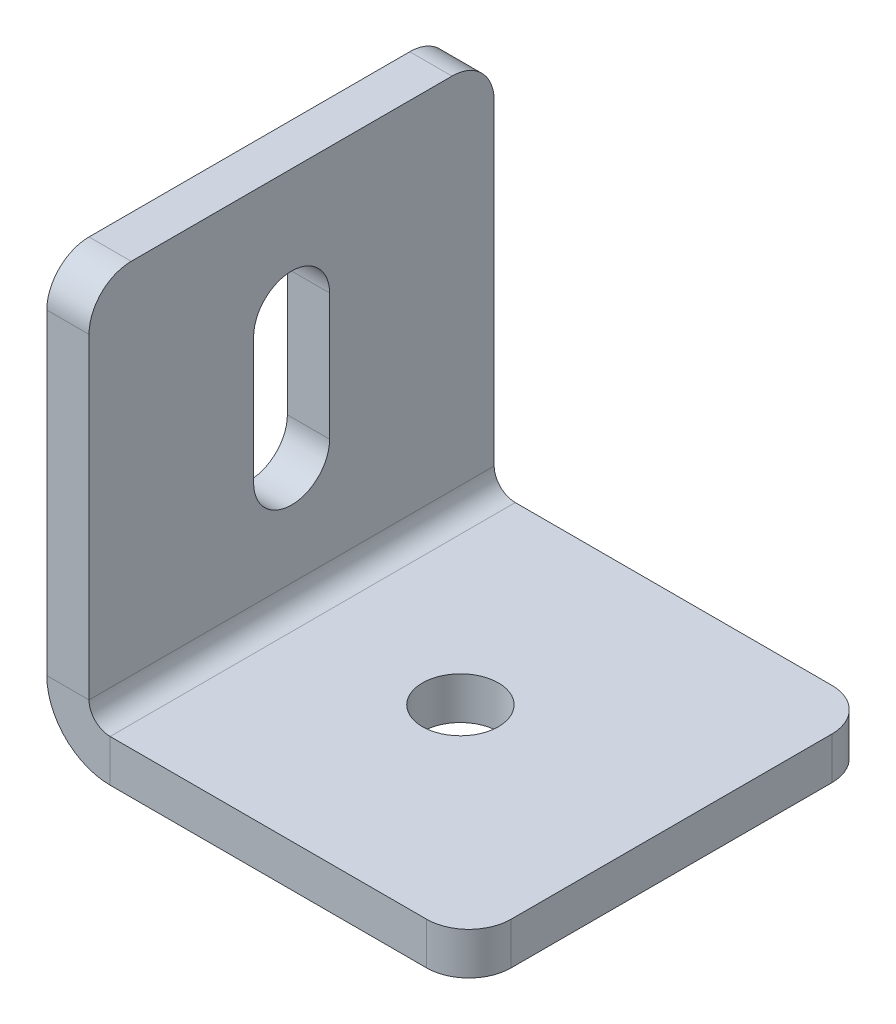
ISO-10303-21;
HEADER;
FILE_DESCRIPTION(('STEP AP214'),'2;1');
FILE_NAME('part.step','',(''),(''),'','','');
FILE_SCHEMA(('AUTOMOTIVE_DESIGN { 1 0 10303 214 1 1 1 1 }'));
ENDSEC;
DATA;
#1=APPLICATION_CONTEXT('core data for automotive mechanical design processes');
#2=APPLICATION_PROTOCOL_DEFINITION('international standard','automotive_design',2000,#1);
#3=PRODUCT_CONTEXT('',#1,'mechanical');
#4=PRODUCT('Part','Part','',(#3));
#5=PRODUCT_RELATED_PRODUCT_CATEGORY('part','',(#4));
#6=PRODUCT_DEFINITION_FORMATION('','',#4);
#7=PRODUCT_DEFINITION_CONTEXT('part definition',#1,'design');
#8=PRODUCT_DEFINITION('design','',#6,#7);
#9=PRODUCT_DEFINITION_SHAPE('','',#8);
#10=(LENGTH_UNIT() NAMED_UNIT(*) SI_UNIT(.MILLI.,.METRE.));
#11=(NAMED_UNIT(*) PLANE_ANGLE_UNIT() SI_UNIT($,.RADIAN.));
#12=(NAMED_UNIT(*) SI_UNIT($,.STERADIAN.) SOLID_ANGLE_UNIT());
#13=UNCERTAINTY_MEASURE_WITH_UNIT(LENGTH_MEASURE(1.E-05),#10,'distance_accuracy_value','');
#14=(GEOMETRIC_REPRESENTATION_CONTEXT(3) GLOBAL_UNCERTAINTY_ASSIGNED_CONTEXT((#13)) GLOBAL_UNIT_ASSIGNED_CONTEXT((#10,
#11,#12)) REPRESENTATION_CONTEXT('',''));
#15=CARTESIAN_POINT('',(0.,0.,0.));
#16=DIRECTION('',(0.,0.,1.));
#17=DIRECTION('',(1.,0.,0.));
#18=AXIS2_PLACEMENT_3D('',#15,#16,#17);
#19=CARTESIAN_POINT('',(0.,20.,0.));
#20=DIRECTION('',(-1.,0.,0.));
#21=DIRECTION('',(0.,0.,1.));
#22=AXIS2_PLACEMENT_3D('',#19,#20,#21);
#23=CYLINDRICAL_SURFACE('',#22,4.5);
#24=CARTESIAN_POINT('',(5.,20.,0.));
#25=DIRECTION('',(1.,0.,0.));
#26=DIRECTION('',(0.,0.,-1.));
#27=AXIS2_PLACEMENT_3D('',#24,#25,#26);
#28=CIRCLE('',#27,4.5);
#29=CARTESIAN_POINT('',(5.,20.,4.5));
#30=VERTEX_POINT('',#29);
#31=CARTESIAN_POINT('',(5.,20.,-4.5));
#32=VERTEX_POINT('',#31);
#33=EDGE_CURVE('E283',#30,#32,#28,.T.);
#34=ORIENTED_EDGE('',*,*,#33,.T.);
#35=DIRECTION('',(1.,0.,0.));
#36=VECTOR('',#35,1.);
#37=CARTESIAN_POINT('',(0.,20.,-4.5));
#38=LINE('',#37,#36);
#39=CARTESIAN_POINT('',(0.,20.,-4.5));
#40=VERTEX_POINT('',#39);
#41=EDGE_CURVE('E203',#40,#32,#38,.T.);
#42=ORIENTED_EDGE('',*,*,#41,.F.);
#43=CARTESIAN_POINT('',(0.,20.,0.));
#44=DIRECTION('',(1.,0.,0.));
#45=DIRECTION('',(0.,0.,-1.));
#46=AXIS2_PLACEMENT_3D('',#43,#44,#45);
#47=CIRCLE('',#46,4.5);
#48=CARTESIAN_POINT('',(0.,20.,4.5));
#49=VERTEX_POINT('',#48);
#50=EDGE_CURVE('E208',#49,#40,#47,.T.);
#51=ORIENTED_EDGE('',*,*,#50,.F.);
#52=DIRECTION('',(1.,0.,0.));
#53=VECTOR('',#52,1.);
#54=CARTESIAN_POINT('',(0.,20.,4.5));
#55=LINE('',#54,#53);
#56=EDGE_CURVE('E170',#49,#30,#55,.T.);
#57=ORIENTED_EDGE('',*,*,#56,.T.);
#58=EDGE_LOOP('',(#34,#42,#51,#57));
#59=FACE_BOUND('',#58,.T.);
#60=ADVANCED_FACE('F48',(#59),#23,.F.);
#61=CARTESIAN_POINT('',(0.,0.,24.));
#62=DIRECTION('',(0.,0.,-1.));
#63=DIRECTION('',(0.,-1.,0.));
#64=AXIS2_PLACEMENT_3D('',#61,#62,#63);
#65=PLANE('',#64);
#66=DIRECTION('',(0.,1.,0.));
#67=VECTOR('',#66,1.);
#68=CARTESIAN_POINT('',(5.,0.,24.));
#69=LINE('',#68,#67);
#70=CARTESIAN_POINT('',(5.,45.,24.));
#71=VERTEX_POINT('',#70);
#72=CARTESIAN_POINT('',(5.,7.5,24.));
#73=VERTEX_POINT('',#72);
#74=EDGE_CURVE('E289',#71,#73,#69,.F.);
#75=ORIENTED_EDGE('',*,*,#74,.F.);
#76=DIRECTION('',(1.,0.,0.));
#77=VECTOR('',#76,1.);
#78=CARTESIAN_POINT('',(0.,45.,24.));
#79=LINE('',#78,#77);
#80=CARTESIAN_POINT('',(0.,45.,24.));
#81=VERTEX_POINT('',#80);
#82=EDGE_CURVE('E11',#71,#81,#79,.F.);
#83=ORIENTED_EDGE('',*,*,#82,.T.);
#84=DIRECTION('',(0.,-1.,0.));
#85=VECTOR('',#84,1.);
#86=CARTESIAN_POINT('',(0.,0.,24.));
#87=LINE('',#86,#85);
#88=CARTESIAN_POINT('',(0.,7.5,24.));
#89=VERTEX_POINT('',#88);
#90=EDGE_CURVE('E211',#81,#89,#87,.T.);
#91=ORIENTED_EDGE('',*,*,#90,.T.);
#92=DIRECTION('',(-1.,0.,0.));
#93=VECTOR('',#92,1.);
#94=CARTESIAN_POINT('',(0.,7.5,24.));
#95=LINE('',#94,#93);
#96=EDGE_CURVE('E305',#73,#89,#95,.T.);
#97=ORIENTED_EDGE('',*,*,#96,.F.);
#98=EDGE_LOOP('',(#75,#83,#91,#97));
#99=FACE_BOUND('',#98,.T.);
#100=ADVANCED_FACE('F385',(#99),#65,.F.);
#101=CARTESIAN_POINT('',(0.,50.,-24.));
#102=DIRECTION('',(0.,-1.,0.));
#103=DIRECTION('',(0.,0.,1.));
#104=AXIS2_PLACEMENT_3D('',#101,#102,#103);
#105=PLANE('',#104);
#106=DIRECTION('',(0.,0.,1.));
#107=VECTOR('',#106,1.);
#108=CARTESIAN_POINT('',(5.,50.,-24.));
#109=LINE('',#108,#107);
#110=CARTESIAN_POINT('',(5.,50.,-19.));
#111=VERTEX_POINT('',#110);
#112=CARTESIAN_POINT('',(5.,50.,19.));
#113=VERTEX_POINT('',#112);
#114=EDGE_CURVE('E286',#111,#113,#109,.T.);
#115=ORIENTED_EDGE('',*,*,#114,.F.);
#116=DIRECTION('',(-1.,0.,0.));
#117=VECTOR('',#116,1.);
#118=CARTESIAN_POINT('',(0.,50.,-19.));
#119=LINE('',#118,#117);
#120=CARTESIAN_POINT('',(0.,50.,-19.));
#121=VERTEX_POINT('',#120);
#122=EDGE_CURVE('E340',#111,#121,#119,.T.);
#123=ORIENTED_EDGE('',*,*,#122,.T.);
#124=DIRECTION('',(0.,0.,1.));
#125=VECTOR('',#124,1.);
#126=CARTESIAN_POINT('',(0.,50.,-24.));
#127=LINE('',#126,#125);
#128=CARTESIAN_POINT('',(0.,50.,19.));
#129=VERTEX_POINT('',#128);
#130=EDGE_CURVE('E215',#121,#129,#127,.T.);
#131=ORIENTED_EDGE('',*,*,#130,.T.);
#132=DIRECTION('',(1.,0.,0.));
#133=VECTOR('',#132,1.);
#134=CARTESIAN_POINT('',(0.,50.,19.));
#135=LINE('',#134,#133);
#136=EDGE_CURVE('E337',#129,#113,#135,.T.);
#137=ORIENTED_EDGE('',*,*,#136,.T.);
#138=EDGE_LOOP('',(#115,#123,#131,#137));
#139=FACE_BOUND('',#138,.T.);
#140=ADVANCED_FACE('F365',(#139),#105,.F.);
#141=CARTESIAN_POINT('',(0.,0.,-24.));
#142=DIRECTION('',(0.,0.,-1.));
#143=DIRECTION('',(0.,-1.,0.));
#144=AXIS2_PLACEMENT_3D('',#141,#142,#143);
#145=PLANE('',#144);
#146=DIRECTION('',(0.,-1.,0.));
#147=VECTOR('',#146,1.);
#148=CARTESIAN_POINT('',(0.,0.,-24.));
#149=LINE('',#148,#147);
#150=CARTESIAN_POINT('',(0.,45.,-24.));
#151=VERTEX_POINT('',#150);
#152=CARTESIAN_POINT('',(0.,7.5,-24.));
#153=VERTEX_POINT('',#152);
#154=EDGE_CURVE('E219',#151,#153,#149,.T.);
#155=ORIENTED_EDGE('',*,*,#154,.F.);
#156=DIRECTION('',(1.,0.,0.));
#157=VECTOR('',#156,1.);
#158=CARTESIAN_POINT('',(0.,45.,-24.));
#159=LINE('',#158,#157);
#160=CARTESIAN_POINT('',(5.,45.,-24.));
#161=VERTEX_POINT('',#160);
#162=EDGE_CURVE('E350',#151,#161,#159,.T.);
#163=ORIENTED_EDGE('',*,*,#162,.T.);
#164=DIRECTION('',(0.,1.,0.));
#165=VECTOR('',#164,1.);
#166=CARTESIAN_POINT('',(5.,0.,-24.));
#167=LINE('',#166,#165);
#168=CARTESIAN_POINT('',(5.,7.5,-24.));
#169=VERTEX_POINT('',#168);
#170=EDGE_CURVE('E268',#161,#169,#167,.F.);
#171=ORIENTED_EDGE('',*,*,#170,.T.);
#172=DIRECTION('',(-1.,0.,0.));
#173=VECTOR('',#172,1.);
#174=CARTESIAN_POINT('',(0.,7.5,-24.));
#175=LINE('',#174,#173);
#176=EDGE_CURVE('E301',#169,#153,#175,.T.);
#177=ORIENTED_EDGE('',*,*,#176,.T.);
#178=EDGE_LOOP('',(#155,#163,#171,#177));
#179=FACE_BOUND('',#178,.T.);
#180=ADVANCED_FACE('F371',(#179),#145,.T.);
#181=CARTESIAN_POINT('',(7.5,7.5,-24.));
#182=DIRECTION('',(0.,0.,1.));
#183=DIRECTION('',(1.,0.,0.));
#184=AXIS2_PLACEMENT_3D('',#181,#182,#183);
#185=PLANE('',#184);
#186=ORIENTED_EDGE('',*,*,#176,.F.);
#187=CARTESIAN_POINT('',(7.5,7.5,-24.));
#188=DIRECTION('',(0.,0.,1.));
#189=DIRECTION('',(1.,0.,0.));
#190=AXIS2_PLACEMENT_3D('',#187,#188,#189);
#191=CIRCLE('',#190,2.5);
#192=CARTESIAN_POINT('',(7.5,5.,-24.));
#193=VERTEX_POINT('',#192);
#194=EDGE_CURVE('E279',#169,#193,#191,.T.);
#195=ORIENTED_EDGE('',*,*,#194,.T.);
#196=DIRECTION('',(0.,-1.,0.));
#197=VECTOR('',#196,1.);
#198=CARTESIAN_POINT('',(7.5,0.,-24.));
#199=LINE('',#198,#197);
#200=CARTESIAN_POINT('',(7.5,0.,-24.));
#201=VERTEX_POINT('',#200);
#202=EDGE_CURVE('E298',#193,#201,#199,.T.);
#203=ORIENTED_EDGE('',*,*,#202,.T.);
#204=CARTESIAN_POINT('',(7.5,7.5,-24.));
#205=DIRECTION('',(0.,0.,-1.));
#206=DIRECTION('',(-1.,0.,0.));
#207=AXIS2_PLACEMENT_3D('',#204,#205,#206);
#208=CIRCLE('',#207,7.5);
#209=EDGE_CURVE('E212',#153,#201,#208,.F.);
#210=ORIENTED_EDGE('',*,*,#209,.F.);
#211=EDGE_LOOP('',(#186,#195,#203,#210));
#212=FACE_BOUND('',#211,.T.);
#213=ADVANCED_FACE('F376',(#212),#185,.F.);
#214=CARTESIAN_POINT('',(50.,0.,-24.));
#215=DIRECTION('',(0.,0.,-1.));
#216=DIRECTION('',(1.,0.,0.));
#217=AXIS2_PLACEMENT_3D('',#214,#215,#216);
#218=PLANE('',#217);
#219=DIRECTION('',(1.,0.,0.));
#220=VECTOR('',#219,1.);
#221=CARTESIAN_POINT('',(50.,5.,-24.));
#222=LINE('',#221,#220);
#223=CARTESIAN_POINT('',(45.,5.,-24.));
#224=VERTEX_POINT('',#223);
#225=EDGE_CURVE('E262',#193,#224,#222,.T.);
#226=ORIENTED_EDGE('',*,*,#225,.T.);
#227=DIRECTION('',(0.,-1.,0.));
#228=VECTOR('',#227,1.);
#229=CARTESIAN_POINT('',(45.,0.,-24.));
#230=LINE('',#229,#228);
#231=CARTESIAN_POINT('',(45.,0.,-24.));
#232=VERTEX_POINT('',#231);
#233=EDGE_CURVE('E309',#224,#232,#230,.T.);
#234=ORIENTED_EDGE('',*,*,#233,.T.);
#235=DIRECTION('',(1.,0.,0.));
#236=VECTOR('',#235,1.);
#237=CARTESIAN_POINT('',(50.,0.,-24.));
#238=LINE('',#237,#236);
#239=EDGE_CURVE('E234',#201,#232,#238,.T.);
#240=ORIENTED_EDGE('',*,*,#239,.F.);
#241=ORIENTED_EDGE('',*,*,#202,.F.);
#242=EDGE_LOOP('',(#226,#234,#240,#241));
#243=FACE_BOUND('',#242,.T.);
#244=ADVANCED_FACE('F418',(#243),#218,.T.);
#245=CARTESIAN_POINT('',(50.,0.,-24.));
#246=DIRECTION('',(1.,0.,0.));
#247=DIRECTION('',(0.,0.,1.));
#248=AXIS2_PLACEMENT_3D('',#245,#246,#247);
#249=PLANE('',#248);
#250=DIRECTION('',(0.,0.,1.));
#251=VECTOR('',#250,1.);
#252=CARTESIAN_POINT('',(50.,0.,-24.));
#253=LINE('',#252,#251);
#254=CARTESIAN_POINT('',(50.,0.,-19.));
#255=VERTEX_POINT('',#254);
#256=CARTESIAN_POINT('',(50.,0.,19.));
#257=VERTEX_POINT('',#256);
#258=EDGE_CURVE('E226',#255,#257,#253,.T.);
#259=ORIENTED_EDGE('',*,*,#258,.F.);
#260=DIRECTION('',(0.,-1.,0.));
#261=VECTOR('',#260,1.);
#262=CARTESIAN_POINT('',(50.,0.,-19.));
#263=LINE('',#262,#261);
#264=CARTESIAN_POINT('',(50.,5.,-19.));
#265=VERTEX_POINT('',#264);
#266=EDGE_CURVE('E325',#255,#265,#263,.F.);
#267=ORIENTED_EDGE('',*,*,#266,.T.);
#268=DIRECTION('',(0.,0.,1.));
#269=VECTOR('',#268,1.);
#270=CARTESIAN_POINT('',(50.,5.,-24.));
#271=LINE('',#270,#269);
#272=CARTESIAN_POINT('',(50.,5.,19.));
#273=VERTEX_POINT('',#272);
#274=EDGE_CURVE('E267',#265,#273,#271,.T.);
#275=ORIENTED_EDGE('',*,*,#274,.T.);
#276=DIRECTION('',(0.,1.,0.));
#277=VECTOR('',#276,1.);
#278=CARTESIAN_POINT('',(50.,0.,19.));
#279=LINE('',#278,#277);
#280=EDGE_CURVE('E321',#273,#257,#279,.F.);
#281=ORIENTED_EDGE('',*,*,#280,.T.);
#282=EDGE_LOOP('',(#259,#267,#275,#281));
#283=FACE_BOUND('',#282,.T.);
#284=ADVANCED_FACE('F409',(#283),#249,.T.);
#285=CARTESIAN_POINT('',(50.,0.,24.));
#286=DIRECTION('',(0.,0.,-1.));
#287=DIRECTION('',(1.,0.,0.));
#288=AXIS2_PLACEMENT_3D('',#285,#286,#287);
#289=PLANE('',#288);
#290=DIRECTION('',(1.,0.,0.));
#291=VECTOR('',#290,1.);
#292=CARTESIAN_POINT('',(50.,0.,24.));
#293=LINE('',#292,#291);
#294=CARTESIAN_POINT('',(7.5,0.,24.));
#295=VERTEX_POINT('',#294);
#296=CARTESIAN_POINT('',(45.,0.,24.));
#297=VERTEX_POINT('',#296);
#298=EDGE_CURVE('E230',#295,#297,#293,.T.);
#299=ORIENTED_EDGE('',*,*,#298,.T.);
#300=DIRECTION('',(0.,-1.,0.));
#301=VECTOR('',#300,1.);
#302=CARTESIAN_POINT('',(45.,0.,24.));
#303=LINE('',#302,#301);
#304=CARTESIAN_POINT('',(45.,5.,24.));
#305=VERTEX_POINT('',#304);
#306=EDGE_CURVE('E334',#297,#305,#303,.F.);
#307=ORIENTED_EDGE('',*,*,#306,.T.);
#308=DIRECTION('',(1.,0.,0.));
#309=VECTOR('',#308,1.);
#310=CARTESIAN_POINT('',(50.,5.,24.));
#311=LINE('',#310,#309);
#312=CARTESIAN_POINT('',(7.5,5.,24.));
#313=VERTEX_POINT('',#312);
#314=EDGE_CURVE('E269',#313,#305,#311,.T.);
#315=ORIENTED_EDGE('',*,*,#314,.F.);
#316=DIRECTION('',(0.,-1.,0.));
#317=VECTOR('',#316,1.);
#318=CARTESIAN_POINT('',(7.5,0.,24.));
#319=LINE('',#318,#317);
#320=EDGE_CURVE('E246',#313,#295,#319,.T.);
#321=ORIENTED_EDGE('',*,*,#320,.T.);
#322=EDGE_LOOP('',(#299,#307,#315,#321));
#323=FACE_BOUND('',#322,.T.);
#324=ADVANCED_FACE('F396',(#323),#289,.F.);
#325=CARTESIAN_POINT('',(25.,0.,0.));
#326=DIRECTION('',(0.,-1.,0.));
#327=DIRECTION('',(1.,0.,0.));
#328=AXIS2_PLACEMENT_3D('',#325,#326,#327);
#329=CYLINDRICAL_SURFACE('',#328,4.5);
#330=CARTESIAN_POINT('',(25.,0.,0.));
#331=DIRECTION('',(0.,-1.,0.));
#332=DIRECTION('',(0.,0.,-1.));
#333=AXIS2_PLACEMENT_3D('',#330,#331,#332);
#334=CIRCLE('',#333,4.5);
#335=CARTESIAN_POINT('',(25.,0.,-4.49999999999999));
#336=VERTEX_POINT('',#335);
#337=EDGE_CURVE('E222',#336,#336,#334,.T.);
#338=ORIENTED_EDGE('',*,*,#337,.T.);
#339=EDGE_LOOP('',(#338));
#340=FACE_BOUND('',#339,.T.);
#341=CARTESIAN_POINT('',(25.,5.,0.));
#342=DIRECTION('',(0.,-1.,0.));
#343=DIRECTION('',(0.,0.,-1.));
#344=AXIS2_PLACEMENT_3D('',#341,#342,#343);
#345=CIRCLE('',#344,4.5);
#346=CARTESIAN_POINT('',(25.,5.,-4.49999999999999));
#347=VERTEX_POINT('',#346);
#348=EDGE_CURVE('E263',#347,#347,#345,.T.);
#349=ORIENTED_EDGE('',*,*,#348,.F.);
#350=EDGE_LOOP('',(#349));
#351=FACE_BOUND('',#350,.T.);
#352=ADVANCED_FACE('F471',(#340,#351),#329,.F.);
#353=CARTESIAN_POINT('',(7.5,7.5,24.));
#354=DIRECTION('',(0.,0.,-1.));
#355=DIRECTION('',(-1.,0.,0.));
#356=AXIS2_PLACEMENT_3D('',#353,#354,#355);
#357=PLANE('',#356);
#358=CARTESIAN_POINT('',(7.5,7.5,24.));
#359=DIRECTION('',(0.,0.,1.));
#360=DIRECTION('',(1.,0.,0.));
#361=AXIS2_PLACEMENT_3D('',#358,#359,#360);
#362=CIRCLE('',#361,2.5);
#363=EDGE_CURVE('E202',#313,#73,#362,.F.);
#364=ORIENTED_EDGE('',*,*,#363,.T.);
#365=ORIENTED_EDGE('',*,*,#96,.T.);
#366=CARTESIAN_POINT('',(7.5,7.5,24.));
#367=DIRECTION('',(0.,0.,1.));
#368=DIRECTION('',(1.,0.,0.));
#369=AXIS2_PLACEMENT_3D('',#366,#367,#368);
#370=CIRCLE('',#369,7.5);
#371=EDGE_CURVE('E247',#295,#89,#370,.F.);
#372=ORIENTED_EDGE('',*,*,#371,.F.);
#373=ORIENTED_EDGE('',*,*,#320,.F.);
#374=EDGE_LOOP('',(#364,#365,#372,#373));
#375=FACE_BOUND('',#374,.T.);
#376=ADVANCED_FACE('F388',(#375),#357,.F.);
#377=CARTESIAN_POINT('',(50.,0.,-24.));
#378=DIRECTION('',(0.,-1.,0.));
#379=DIRECTION('',(1.,0.,0.));
#380=AXIS2_PLACEMENT_3D('',#377,#378,#379);
#381=PLANE('',#380);
#382=ORIENTED_EDGE('',*,*,#337,.F.);
#383=EDGE_LOOP('',(#382));
#384=FACE_BOUND('',#383,.T.);
#385=ORIENTED_EDGE('',*,*,#239,.T.);
#386=CARTESIAN_POINT('',(45.,0.,-19.));
#387=DIRECTION('',(0.,-1.,0.));
#388=DIRECTION('',(1.,0.,0.));
#389=AXIS2_PLACEMENT_3D('',#386,#387,#388);
#390=CIRCLE('',#389,5.);
#391=EDGE_CURVE('E318',#232,#255,#390,.T.);
#392=ORIENTED_EDGE('',*,*,#391,.T.);
#393=ORIENTED_EDGE('',*,*,#258,.T.);
#394=CARTESIAN_POINT('',(45.,0.,19.));
#395=DIRECTION('',(0.,-1.,0.));
#396=DIRECTION('',(1.,0.,0.));
#397=AXIS2_PLACEMENT_3D('',#394,#395,#396);
#398=CIRCLE('',#397,5.);
#399=EDGE_CURVE('E315',#257,#297,#398,.T.);
#400=ORIENTED_EDGE('',*,*,#399,.T.);
#401=ORIENTED_EDGE('',*,*,#298,.F.);
#402=DIRECTION('',(0.,0.,1.));
#403=VECTOR('',#402,1.);
#404=CARTESIAN_POINT('',(7.5,0.,-24.));
#405=LINE('',#404,#403);
#406=EDGE_CURVE('E242',#295,#201,#405,.F.);
#407=ORIENTED_EDGE('',*,*,#406,.T.);
#408=EDGE_LOOP('',(#385,#392,#393,#400,#401,#407));
#409=FACE_BOUND('',#408,.T.);
#410=ADVANCED_FACE('F412',(#384,#409),#381,.T.);
#411=CARTESIAN_POINT('',(0.,0.,-24.));
#412=DIRECTION('',(-1.,0.,0.));
#413=DIRECTION('',(0.,0.,1.));
#414=AXIS2_PLACEMENT_3D('',#411,#412,#413);
#415=PLANE('',#414);
#416=DIRECTION('',(0.,1.,0.));
#417=VECTOR('',#416,1.);
#418=CARTESIAN_POINT('',(0.,35.,-4.5));
#419=LINE('',#418,#417);
#420=CARTESIAN_POINT('',(0.,35.,-4.5));
#421=VERTEX_POINT('',#420);
#422=EDGE_CURVE('E171',#40,#421,#419,.T.);
#423=ORIENTED_EDGE('',*,*,#422,.T.);
#424=CARTESIAN_POINT('',(0.,35.,0.));
#425=DIRECTION('',(1.,0.,0.));
#426=DIRECTION('',(0.,0.,-1.));
#427=AXIS2_PLACEMENT_3D('',#424,#425,#426);
#428=CIRCLE('',#427,4.5);
#429=CARTESIAN_POINT('',(0.,35.,4.5));
#430=VERTEX_POINT('',#429);
#431=EDGE_CURVE('E165',#421,#430,#428,.T.);
#432=ORIENTED_EDGE('',*,*,#431,.T.);
#433=DIRECTION('',(0.,-1.,0.));
#434=VECTOR('',#433,1.);
#435=CARTESIAN_POINT('',(0.,35.,4.5));
#436=LINE('',#435,#434);
#437=EDGE_CURVE('E174',#430,#49,#436,.T.);
#438=ORIENTED_EDGE('',*,*,#437,.T.);
#439=ORIENTED_EDGE('',*,*,#50,.T.);
#440=EDGE_LOOP('',(#423,#432,#438,#439));
#441=FACE_BOUND('',#440,.T.);
#442=ORIENTED_EDGE('',*,*,#130,.F.);
#443=CARTESIAN_POINT('',(0.,45.,-19.));
#444=DIRECTION('',(-1.,0.,0.));
#445=DIRECTION('',(0.,0.,1.));
#446=AXIS2_PLACEMENT_3D('',#443,#444,#445);
#447=CIRCLE('',#446,5.);
#448=EDGE_CURVE('E347',#121,#151,#447,.T.);
#449=ORIENTED_EDGE('',*,*,#448,.T.);
#450=ORIENTED_EDGE('',*,*,#154,.T.);
#451=DIRECTION('',(0.,0.,1.));
#452=VECTOR('',#451,1.);
#453=CARTESIAN_POINT('',(0.,7.5,-24.));
#454=LINE('',#453,#452);
#455=EDGE_CURVE('E238',#153,#89,#454,.T.);
#456=ORIENTED_EDGE('',*,*,#455,.T.);
#457=ORIENTED_EDGE('',*,*,#90,.F.);
#458=CARTESIAN_POINT('',(0.,45.,19.));
#459=DIRECTION('',(-1.,0.,0.));
#460=DIRECTION('',(0.,0.,1.));
#461=AXIS2_PLACEMENT_3D('',#458,#459,#460);
#462=CIRCLE('',#461,5.);
#463=EDGE_CURVE('E344',#81,#129,#462,.T.);
#464=ORIENTED_EDGE('',*,*,#463,.T.);
#465=EDGE_LOOP('',(#442,#449,#450,#456,#457,#464));
#466=FACE_BOUND('',#465,.T.);
#467=ADVANCED_FACE('F182',(#441,#466),#415,.T.);
#468=CARTESIAN_POINT('',(7.5,7.5,-24.));
#469=DIRECTION('',(0.,0.,1.));
#470=DIRECTION('',(1.,0.,0.));
#471=AXIS2_PLACEMENT_3D('',#468,#469,#470);
#472=CYLINDRICAL_SURFACE('',#471,7.5);
#473=ORIENTED_EDGE('',*,*,#209,.T.);
#474=ORIENTED_EDGE('',*,*,#406,.F.);
#475=ORIENTED_EDGE('',*,*,#371,.T.);
#476=ORIENTED_EDGE('',*,*,#455,.F.);
#477=EDGE_LOOP('',(#473,#474,#475,#476));
#478=FACE_BOUND('',#477,.T.);
#479=ADVANCED_FACE('F380',(#478),#472,.T.);
#480=CARTESIAN_POINT('',(50.,5.,-24.));
#481=DIRECTION('',(0.,-1.,0.));
#482=DIRECTION('',(1.,0.,0.));
#483=AXIS2_PLACEMENT_3D('',#480,#481,#482);
#484=PLANE('',#483);
#485=ORIENTED_EDGE('',*,*,#348,.T.);
#486=EDGE_LOOP('',(#485));
#487=FACE_BOUND('',#486,.T.);
#488=ORIENTED_EDGE('',*,*,#274,.F.);
#489=CARTESIAN_POINT('',(45.,5.,-19.));
#490=DIRECTION('',(0.,-1.,0.));
#491=DIRECTION('',(1.,0.,0.));
#492=AXIS2_PLACEMENT_3D('',#489,#490,#491);
#493=CIRCLE('',#492,5.);
#494=EDGE_CURVE('E331',#265,#224,#493,.F.);
#495=ORIENTED_EDGE('',*,*,#494,.T.);
#496=ORIENTED_EDGE('',*,*,#225,.F.);
#497=DIRECTION('',(0.,0.,1.));
#498=VECTOR('',#497,1.);
#499=CARTESIAN_POINT('',(7.5,5.,-24.));
#500=LINE('',#499,#498);
#501=EDGE_CURVE('E251',#313,#193,#500,.F.);
#502=ORIENTED_EDGE('',*,*,#501,.F.);
#503=ORIENTED_EDGE('',*,*,#314,.T.);
#504=CARTESIAN_POINT('',(45.,5.,19.));
#505=DIRECTION('',(0.,-1.,0.));
#506=DIRECTION('',(1.,0.,0.));
#507=AXIS2_PLACEMENT_3D('',#504,#505,#506);
#508=CIRCLE('',#507,5.);
#509=EDGE_CURVE('E328',#305,#273,#508,.F.);
#510=ORIENTED_EDGE('',*,*,#509,.T.);
#511=EDGE_LOOP('',(#488,#495,#496,#502,#503,#510));
#512=FACE_BOUND('',#511,.T.);
#513=ADVANCED_FACE('F402',(#487,#512),#484,.F.);
#514=CARTESIAN_POINT('',(5.,0.,-24.));
#515=DIRECTION('',(-1.,0.,0.));
#516=DIRECTION('',(0.,0.,1.));
#517=AXIS2_PLACEMENT_3D('',#514,#515,#516);
#518=PLANE('',#517);
#519=CARTESIAN_POINT('',(5.,35.,0.));
#520=DIRECTION('',(1.,0.,0.));
#521=DIRECTION('',(0.,0.,-1.));
#522=AXIS2_PLACEMENT_3D('',#519,#520,#521);
#523=CIRCLE('',#522,4.5);
#524=CARTESIAN_POINT('',(5.,35.,-4.5));
#525=VERTEX_POINT('',#524);
#526=CARTESIAN_POINT('',(5.,35.,4.5));
#527=VERTEX_POINT('',#526);
#528=EDGE_CURVE('E64',#525,#527,#523,.T.);
#529=ORIENTED_EDGE('',*,*,#528,.F.);
#530=DIRECTION('',(0.,1.,0.));
#531=VECTOR('',#530,1.);
#532=CARTESIAN_POINT('',(5.,35.,-4.5));
#533=LINE('',#532,#531);
#534=EDGE_CURVE('E185',#32,#525,#533,.T.);
#535=ORIENTED_EDGE('',*,*,#534,.F.);
#536=ORIENTED_EDGE('',*,*,#33,.F.);
#537=DIRECTION('',(0.,-1.,0.));
#538=VECTOR('',#537,1.);
#539=CARTESIAN_POINT('',(5.,35.,4.5));
#540=LINE('',#539,#538);
#541=EDGE_CURVE('E190',#527,#30,#540,.T.);
#542=ORIENTED_EDGE('',*,*,#541,.F.);
#543=EDGE_LOOP('',(#529,#535,#536,#542));
#544=FACE_BOUND('',#543,.T.);
#545=ORIENTED_EDGE('',*,*,#170,.F.);
#546=CARTESIAN_POINT('',(5.,45.,-19.));
#547=DIRECTION('',(-1.,0.,0.));
#548=DIRECTION('',(0.,0.,1.));
#549=AXIS2_PLACEMENT_3D('',#546,#547,#548);
#550=CIRCLE('',#549,5.);
#551=EDGE_CURVE('E57',#161,#111,#550,.F.);
#552=ORIENTED_EDGE('',*,*,#551,.T.);
#553=ORIENTED_EDGE('',*,*,#114,.T.);
#554=CARTESIAN_POINT('',(5.,45.,19.));
#555=DIRECTION('',(-1.,0.,0.));
#556=DIRECTION('',(0.,0.,1.));
#557=AXIS2_PLACEMENT_3D('',#554,#555,#556);
#558=CIRCLE('',#557,5.);
#559=EDGE_CURVE('E72',#113,#71,#558,.F.);
#560=ORIENTED_EDGE('',*,*,#559,.T.);
#561=ORIENTED_EDGE('',*,*,#74,.T.);
#562=DIRECTION('',(0.,0.,1.));
#563=VECTOR('',#562,1.);
#564=CARTESIAN_POINT('',(5.,7.5,-24.));
#565=LINE('',#564,#563);
#566=EDGE_CURVE('E258',#169,#73,#565,.T.);
#567=ORIENTED_EDGE('',*,*,#566,.F.);
#568=EDGE_LOOP('',(#545,#552,#553,#560,#561,#567));
#569=FACE_BOUND('',#568,.T.);
#570=ADVANCED_FACE('F359',(#544,#569),#518,.F.);
#571=CARTESIAN_POINT('',(7.5,7.5,-24.));
#572=DIRECTION('',(0.,0.,1.));
#573=DIRECTION('',(1.,0.,0.));
#574=AXIS2_PLACEMENT_3D('',#571,#572,#573);
#575=CYLINDRICAL_SURFACE('',#574,2.5);
#576=ORIENTED_EDGE('',*,*,#194,.F.);
#577=ORIENTED_EDGE('',*,*,#566,.T.);
#578=ORIENTED_EDGE('',*,*,#363,.F.);
#579=ORIENTED_EDGE('',*,*,#501,.T.);
#580=EDGE_LOOP('',(#576,#577,#578,#579));
#581=FACE_BOUND('',#580,.T.);
#582=ADVANCED_FACE('F394',(#581),#575,.F.);
#583=CARTESIAN_POINT('',(45.,0.,-19.));
#584=DIRECTION('',(0.,-1.,0.));
#585=DIRECTION('',(1.,0.,0.));
#586=AXIS2_PLACEMENT_3D('',#583,#584,#585);
#587=CYLINDRICAL_SURFACE('',#586,5.);
#588=ORIENTED_EDGE('',*,*,#494,.F.);
#589=ORIENTED_EDGE('',*,*,#266,.F.);
#590=ORIENTED_EDGE('',*,*,#391,.F.);
#591=ORIENTED_EDGE('',*,*,#233,.F.);
#592=EDGE_LOOP('',(#588,#589,#590,#591));
#593=FACE_BOUND('',#592,.T.);
#594=ADVANCED_FACE('F416',(#593),#587,.T.);
#595=CARTESIAN_POINT('',(45.,0.,19.));
#596=DIRECTION('',(0.,1.,0.));
#597=DIRECTION('',(-1.,0.,0.));
#598=AXIS2_PLACEMENT_3D('',#595,#596,#597);
#599=CYLINDRICAL_SURFACE('',#598,5.);
#600=ORIENTED_EDGE('',*,*,#509,.F.);
#601=ORIENTED_EDGE('',*,*,#306,.F.);
#602=ORIENTED_EDGE('',*,*,#399,.F.);
#603=ORIENTED_EDGE('',*,*,#280,.F.);
#604=EDGE_LOOP('',(#600,#601,#602,#603));
#605=FACE_BOUND('',#604,.T.);
#606=ADVANCED_FACE('F406',(#605),#599,.T.);
#607=CARTESIAN_POINT('',(0.,45.,-19.));
#608=DIRECTION('',(1.,0.,0.));
#609=DIRECTION('',(0.,0.,-1.));
#610=AXIS2_PLACEMENT_3D('',#607,#608,#609);
#611=CYLINDRICAL_SURFACE('',#610,5.);
#612=ORIENTED_EDGE('',*,*,#551,.F.);
#613=ORIENTED_EDGE('',*,*,#162,.F.);
#614=ORIENTED_EDGE('',*,*,#448,.F.);
#615=ORIENTED_EDGE('',*,*,#122,.F.);
#616=EDGE_LOOP('',(#612,#613,#614,#615));
#617=FACE_BOUND('',#616,.T.);
#618=ADVANCED_FACE('F368',(#617),#611,.T.);
#619=CARTESIAN_POINT('',(0.,45.,19.));
#620=DIRECTION('',(-1.,0.,0.));
#621=DIRECTION('',(0.,0.,1.));
#622=AXIS2_PLACEMENT_3D('',#619,#620,#621);
#623=CYLINDRICAL_SURFACE('',#622,5.);
#624=ORIENTED_EDGE('',*,*,#559,.F.);
#625=ORIENTED_EDGE('',*,*,#136,.F.);
#626=ORIENTED_EDGE('',*,*,#463,.F.);
#627=ORIENTED_EDGE('',*,*,#82,.F.);
#628=EDGE_LOOP('',(#624,#625,#626,#627));
#629=FACE_BOUND('',#628,.T.);
#630=ADVANCED_FACE('F50',(#629),#623,.T.);
#631=CARTESIAN_POINT('',(0.,35.,0.));
#632=DIRECTION('',(1.,0.,0.));
#633=DIRECTION('',(0.,0.,-1.));
#634=AXIS2_PLACEMENT_3D('',#631,#632,#633);
#635=CYLINDRICAL_SURFACE('',#634,4.5);
#636=ORIENTED_EDGE('',*,*,#528,.T.);
#637=DIRECTION('',(1.,0.,0.));
#638=VECTOR('',#637,1.);
#639=CARTESIAN_POINT('',(0.,35.,4.5));
#640=LINE('',#639,#638);
#641=EDGE_CURVE('E161',#430,#527,#640,.T.);
#642=ORIENTED_EDGE('',*,*,#641,.F.);
#643=ORIENTED_EDGE('',*,*,#431,.F.);
#644=DIRECTION('',(1.,0.,0.));
#645=VECTOR('',#644,1.);
#646=CARTESIAN_POINT('',(0.,35.,-4.5));
#647=LINE('',#646,#645);
#648=EDGE_CURVE('E199',#421,#525,#647,.T.);
#649=ORIENTED_EDGE('',*,*,#648,.T.);
#650=EDGE_LOOP('',(#636,#642,#643,#649));
#651=FACE_BOUND('',#650,.T.);
#652=ADVANCED_FACE('F163',(#651),#635,.F.);
#653=CARTESIAN_POINT('',(0.,35.,-4.5));
#654=DIRECTION('',(0.,0.,-1.));
#655=DIRECTION('',(0.,1.,0.));
#656=AXIS2_PLACEMENT_3D('',#653,#654,#655);
#657=PLANE('',#656);
#658=ORIENTED_EDGE('',*,*,#534,.T.);
#659=ORIENTED_EDGE('',*,*,#648,.F.);
#660=ORIENTED_EDGE('',*,*,#422,.F.);
#661=ORIENTED_EDGE('',*,*,#41,.T.);
#662=EDGE_LOOP('',(#658,#659,#660,#661));
#663=FACE_BOUND('',#662,.T.);
#664=ADVANCED_FACE('F447',(#663),#657,.F.);
#665=CARTESIAN_POINT('',(0.,35.,4.5));
#666=DIRECTION('',(0.,0.,1.));
#667=DIRECTION('',(0.,-1.,0.));
#668=AXIS2_PLACEMENT_3D('',#665,#666,#667);
#669=PLANE('',#668);
#670=ORIENTED_EDGE('',*,*,#541,.T.);
#671=ORIENTED_EDGE('',*,*,#56,.F.);
#672=ORIENTED_EDGE('',*,*,#437,.F.);
#673=ORIENTED_EDGE('',*,*,#641,.T.);
#674=EDGE_LOOP('',(#670,#671,#672,#673));
#675=FACE_BOUND('',#674,.T.);
#676=ADVANCED_FACE('F175',(#675),#669,.F.);
#677=CLOSED_SHELL('',(#60,#100,#140,#180,#213,#244,#284,#324,#352,#376,#410,#467,#479,#513,#570,
#582,#594,#606,#618,#630,#652,#664,#676));
#678=MANIFOLD_SOLID_BREP('B2',#677);
#679=ADVANCED_BREP_SHAPE_REPRESENTATION('',(#18,#678),#14);
#680=SHAPE_DEFINITION_REPRESENTATION(#9,#679);
ENDSEC;
END-ISO-10303-21;
